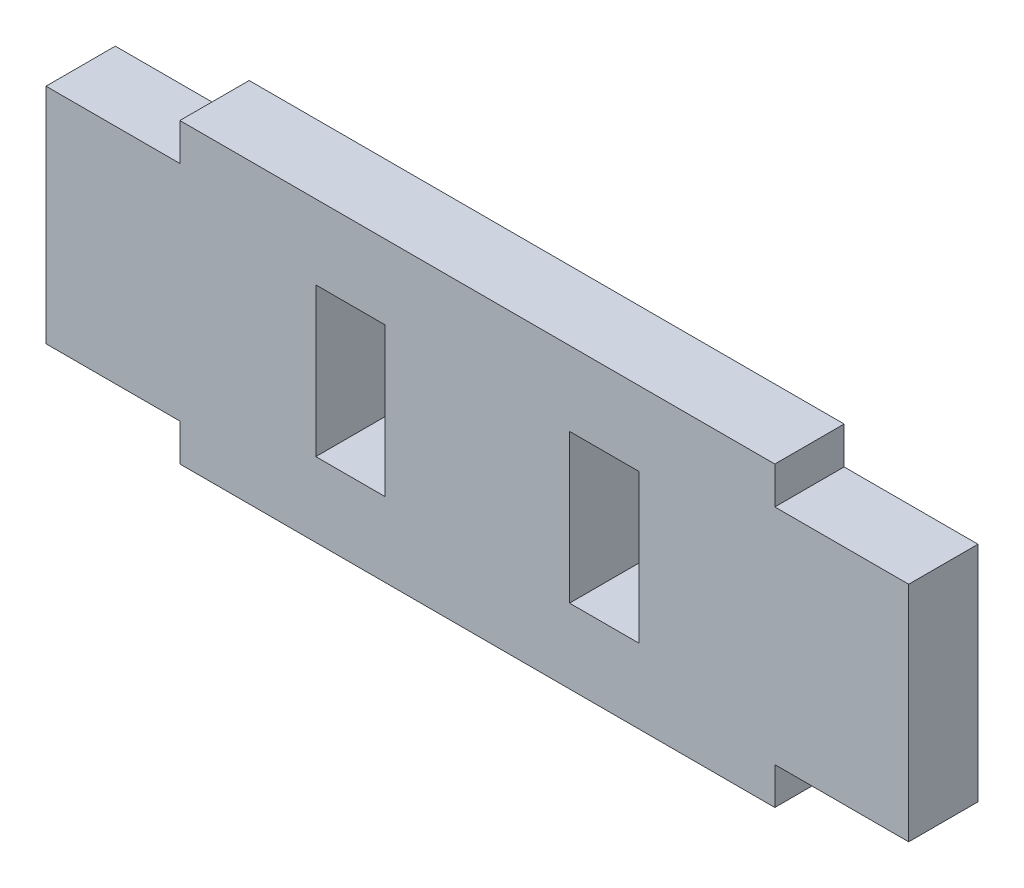
ISO-10303-21;
HEADER;
FILE_DESCRIPTION(('STEP AP214'),'2;1');
FILE_NAME('part.step','',(''),(''),'','','');
FILE_SCHEMA(('AUTOMOTIVE_DESIGN { 1 0 10303 214 1 1 1 1 }'));
ENDSEC;
DATA;
#1=APPLICATION_CONTEXT('core data for automotive mechanical design processes');
#2=APPLICATION_PROTOCOL_DEFINITION('international standard','automotive_design',2000,#1);
#3=PRODUCT_CONTEXT('',#1,'mechanical');
#4=PRODUCT('Part','Part','',(#3));
#5=PRODUCT_RELATED_PRODUCT_CATEGORY('part','',(#4));
#6=PRODUCT_DEFINITION_FORMATION('','',#4);
#7=PRODUCT_DEFINITION_CONTEXT('part definition',#1,'design');
#8=PRODUCT_DEFINITION('design','',#6,#7);
#9=PRODUCT_DEFINITION_SHAPE('','',#8);
#10=(LENGTH_UNIT() NAMED_UNIT(*) SI_UNIT(.MILLI.,.METRE.));
#11=(NAMED_UNIT(*) PLANE_ANGLE_UNIT() SI_UNIT($,.RADIAN.));
#12=(NAMED_UNIT(*) SI_UNIT($,.STERADIAN.) SOLID_ANGLE_UNIT());
#13=UNCERTAINTY_MEASURE_WITH_UNIT(LENGTH_MEASURE(1.E-05),#10,'distance_accuracy_value','');
#14=(GEOMETRIC_REPRESENTATION_CONTEXT(3) GLOBAL_UNCERTAINTY_ASSIGNED_CONTEXT((#13)) GLOBAL_UNIT_ASSIGNED_CONTEXT((#10,
#11,#12)) REPRESENTATION_CONTEXT('',''));
#15=CARTESIAN_POINT('',(0.,0.,0.));
#16=DIRECTION('',(0.,0.,1.));
#17=DIRECTION('',(1.,0.,0.));
#18=AXIS2_PLACEMENT_3D('',#15,#16,#17);
#19=CARTESIAN_POINT('',(0.,0.,1.47955));
#20=DIRECTION('',(0.,0.,1.));
#21=DIRECTION('',(1.,0.,0.));
#22=AXIS2_PLACEMENT_3D('',#19,#20,#21);
#23=PLANE('',#22);
#24=DIRECTION('',(0.,1.,0.));
#25=VECTOR('',#24,1.);
#26=CARTESIAN_POINT('',(-3.937,3.175,1.47955));
#27=LINE('',#26,#25);
#28=CARTESIAN_POINT('',(-3.937,-3.175,1.47955));
#29=VERTEX_POINT('',#28);
#30=CARTESIAN_POINT('',(-3.937,3.175,1.47955));
#31=VERTEX_POINT('',#30);
#32=EDGE_CURVE('E210',#29,#31,#27,.T.);
#33=ORIENTED_EDGE('',*,*,#32,.F.);
#34=DIRECTION('',(1.,0.,0.));
#35=VECTOR('',#34,1.);
#36=CARTESIAN_POINT('',(-3.937,-3.175,1.47955));
#37=LINE('',#36,#35);
#38=CARTESIAN_POINT('',(-6.8961,-3.175,1.47955));
#39=VERTEX_POINT('',#38);
#40=EDGE_CURVE('E208',#39,#29,#37,.T.);
#41=ORIENTED_EDGE('',*,*,#40,.F.);
#42=DIRECTION('',(0.,-1.,0.));
#43=VECTOR('',#42,1.);
#44=CARTESIAN_POINT('',(-6.8961,3.175,1.47955));
#45=LINE('',#44,#43);
#46=CARTESIAN_POINT('',(-6.8961,3.175,1.47955));
#47=VERTEX_POINT('',#46);
#48=EDGE_CURVE('E216',#47,#39,#45,.T.);
#49=ORIENTED_EDGE('',*,*,#48,.F.);
#50=DIRECTION('',(-1.,0.,0.));
#51=VECTOR('',#50,1.);
#52=CARTESIAN_POINT('',(-3.937,3.175,1.47955));
#53=LINE('',#52,#51);
#54=EDGE_CURVE('E213',#31,#47,#53,.T.);
#55=ORIENTED_EDGE('',*,*,#54,.F.);
#56=EDGE_LOOP('',(#33,#41,#49,#55));
#57=FACE_BOUND('',#56,.T.);
#58=DIRECTION('',(0.,1.,0.));
#59=VECTOR('',#58,1.);
#60=CARTESIAN_POINT('',(12.7,-4.7625,1.47955));
#61=LINE('',#60,#59);
#62=CARTESIAN_POINT('',(12.7,-6.35,1.47955));
#63=VERTEX_POINT('',#62);
#64=CARTESIAN_POINT('',(12.7,-4.7625,1.47955));
#65=VERTEX_POINT('',#64);
#66=EDGE_CURVE('E239',#63,#65,#61,.T.);
#67=ORIENTED_EDGE('',*,*,#66,.T.);
#68=DIRECTION('',(1.,0.,0.));
#69=VECTOR('',#68,1.);
#70=CARTESIAN_POINT('',(12.7,-4.7625,1.47955));
#71=LINE('',#70,#69);
#72=CARTESIAN_POINT('',(18.415,-4.7625,1.47955));
#73=VERTEX_POINT('',#72);
#74=EDGE_CURVE('E242',#65,#73,#71,.T.);
#75=ORIENTED_EDGE('',*,*,#74,.T.);
#76=DIRECTION('',(0.,1.,0.));
#77=VECTOR('',#76,1.);
#78=CARTESIAN_POINT('',(18.415,4.7625,1.47955));
#79=LINE('',#78,#77);
#80=CARTESIAN_POINT('',(18.415,4.7625,1.47955));
#81=VERTEX_POINT('',#80);
#82=EDGE_CURVE('E245',#73,#81,#79,.T.);
#83=ORIENTED_EDGE('',*,*,#82,.T.);
#84=DIRECTION('',(-1.,0.,0.));
#85=VECTOR('',#84,1.);
#86=CARTESIAN_POINT('',(12.7,4.7625,1.47955));
#87=LINE('',#86,#85);
#88=CARTESIAN_POINT('',(12.7,4.7625,1.47955));
#89=VERTEX_POINT('',#88);
#90=EDGE_CURVE('E247',#81,#89,#87,.T.);
#91=ORIENTED_EDGE('',*,*,#90,.T.);
#92=DIRECTION('',(0.,1.,0.));
#93=VECTOR('',#92,1.);
#94=CARTESIAN_POINT('',(12.7,6.35,1.47955));
#95=LINE('',#94,#93);
#96=CARTESIAN_POINT('',(12.7,6.35,1.47955));
#97=VERTEX_POINT('',#96);
#98=EDGE_CURVE('E249',#89,#97,#95,.T.);
#99=ORIENTED_EDGE('',*,*,#98,.T.);
#100=DIRECTION('',(-1.,0.,0.));
#101=VECTOR('',#100,1.);
#102=CARTESIAN_POINT('',(-12.7,6.35,1.47955));
#103=LINE('',#102,#101);
#104=CARTESIAN_POINT('',(-12.7,6.35,1.47955));
#105=VERTEX_POINT('',#104);
#106=EDGE_CURVE('E251',#97,#105,#103,.T.);
#107=ORIENTED_EDGE('',*,*,#106,.T.);
#108=DIRECTION('',(0.,-1.,0.));
#109=VECTOR('',#108,1.);
#110=CARTESIAN_POINT('',(-12.7,6.35,1.47955));
#111=LINE('',#110,#109);
#112=CARTESIAN_POINT('',(-12.7,4.7625,1.47955));
#113=VERTEX_POINT('',#112);
#114=EDGE_CURVE('E253',#105,#113,#111,.T.);
#115=ORIENTED_EDGE('',*,*,#114,.T.);
#116=DIRECTION('',(-1.,0.,0.));
#117=VECTOR('',#116,1.);
#118=CARTESIAN_POINT('',(-12.7,4.7625,1.47955));
#119=LINE('',#118,#117);
#120=CARTESIAN_POINT('',(-18.415,4.7625,1.47955));
#121=VERTEX_POINT('',#120);
#122=EDGE_CURVE('E255',#113,#121,#119,.T.);
#123=ORIENTED_EDGE('',*,*,#122,.T.);
#124=DIRECTION('',(0.,-1.,0.));
#125=VECTOR('',#124,1.);
#126=CARTESIAN_POINT('',(-18.415,4.7625,1.47955));
#127=LINE('',#126,#125);
#128=CARTESIAN_POINT('',(-18.415,-4.7625,1.47955));
#129=VERTEX_POINT('',#128);
#130=EDGE_CURVE('E257',#121,#129,#127,.T.);
#131=ORIENTED_EDGE('',*,*,#130,.T.);
#132=DIRECTION('',(1.,0.,0.));
#133=VECTOR('',#132,1.);
#134=CARTESIAN_POINT('',(-12.7,-4.7625,1.47955));
#135=LINE('',#134,#133);
#136=CARTESIAN_POINT('',(-12.7,-4.7625,1.47955));
#137=VERTEX_POINT('',#136);
#138=EDGE_CURVE('E259',#129,#137,#135,.T.);
#139=ORIENTED_EDGE('',*,*,#138,.T.);
#140=DIRECTION('',(0.,-1.,0.));
#141=VECTOR('',#140,1.);
#142=CARTESIAN_POINT('',(-12.7,-4.7625,1.47955));
#143=LINE('',#142,#141);
#144=CARTESIAN_POINT('',(-12.7,-6.35,1.47955));
#145=VERTEX_POINT('',#144);
#146=EDGE_CURVE('E261',#137,#145,#143,.T.);
#147=ORIENTED_EDGE('',*,*,#146,.T.);
#148=DIRECTION('',(1.,0.,0.));
#149=VECTOR('',#148,1.);
#150=CARTESIAN_POINT('',(-12.7,-6.35,1.47955));
#151=LINE('',#150,#149);
#152=EDGE_CURVE('E263',#145,#63,#151,.T.);
#153=ORIENTED_EDGE('',*,*,#152,.T.);
#154=EDGE_LOOP('',(#67,#75,#83,#91,#99,#107,#115,#123,#131,#139,#147,#153));
#155=FACE_BOUND('',#154,.T.);
#156=DIRECTION('',(1.,0.,0.));
#157=VECTOR('',#156,1.);
#158=CARTESIAN_POINT('',(3.937,-3.175,1.47955));
#159=LINE('',#158,#157);
#160=CARTESIAN_POINT('',(3.937,-3.175,1.47955));
#161=VERTEX_POINT('',#160);
#162=CARTESIAN_POINT('',(6.8961,-3.175,1.47955));
#163=VERTEX_POINT('',#162);
#164=EDGE_CURVE('E180',#161,#163,#159,.T.);
#165=ORIENTED_EDGE('',*,*,#164,.F.);
#166=DIRECTION('',(0.,-1.,0.));
#167=VECTOR('',#166,1.);
#168=CARTESIAN_POINT('',(3.937,3.175,1.47955));
#169=LINE('',#168,#167);
#170=CARTESIAN_POINT('',(3.937,3.175,1.47955));
#171=VERTEX_POINT('',#170);
#172=EDGE_CURVE('E172',#171,#161,#169,.T.);
#173=ORIENTED_EDGE('',*,*,#172,.F.);
#174=DIRECTION('',(-1.,0.,0.));
#175=VECTOR('',#174,1.);
#176=CARTESIAN_POINT('',(3.937,3.175,1.47955));
#177=LINE('',#176,#175);
#178=CARTESIAN_POINT('',(6.8961,3.175,1.47955));
#179=VERTEX_POINT('',#178);
#180=EDGE_CURVE('E194',#179,#171,#177,.T.);
#181=ORIENTED_EDGE('',*,*,#180,.F.);
#182=DIRECTION('',(0.,1.,0.));
#183=VECTOR('',#182,1.);
#184=CARTESIAN_POINT('',(6.8961,3.175,1.47955));
#185=LINE('',#184,#183);
#186=EDGE_CURVE('E192',#163,#179,#185,.T.);
#187=ORIENTED_EDGE('',*,*,#186,.F.);
#188=EDGE_LOOP('',(#165,#173,#181,#187));
#189=FACE_BOUND('',#188,.T.);
#190=ADVANCED_FACE('F35',(#57,#155,#189),#23,.T.);
#191=CARTESIAN_POINT('',(0.,0.,-1.47955));
#192=DIRECTION('',(0.,0.,1.));
#193=DIRECTION('',(1.,0.,0.));
#194=AXIS2_PLACEMENT_3D('',#191,#192,#193);
#195=PLANE('',#194);
#196=DIRECTION('',(1.,0.,0.));
#197=VECTOR('',#196,1.);
#198=CARTESIAN_POINT('',(-3.937,-3.175,-1.47955));
#199=LINE('',#198,#197);
#200=CARTESIAN_POINT('',(-6.8961,-3.175,-1.47955));
#201=VERTEX_POINT('',#200);
#202=CARTESIAN_POINT('',(-3.937,-3.175,-1.47955));
#203=VERTEX_POINT('',#202);
#204=EDGE_CURVE('E188',#201,#203,#199,.T.);
#205=ORIENTED_EDGE('',*,*,#204,.T.);
#206=DIRECTION('',(0.,1.,0.));
#207=VECTOR('',#206,1.);
#208=CARTESIAN_POINT('',(-3.937,3.175,-1.47955));
#209=LINE('',#208,#207);
#210=CARTESIAN_POINT('',(-3.937,3.175,-1.47955));
#211=VERTEX_POINT('',#210);
#212=EDGE_CURVE('E221',#203,#211,#209,.T.);
#213=ORIENTED_EDGE('',*,*,#212,.T.);
#214=DIRECTION('',(-1.,0.,0.));
#215=VECTOR('',#214,1.);
#216=CARTESIAN_POINT('',(-3.937,3.175,-1.47955));
#217=LINE('',#216,#215);
#218=CARTESIAN_POINT('',(-6.8961,3.175,-1.47955));
#219=VERTEX_POINT('',#218);
#220=EDGE_CURVE('E224',#211,#219,#217,.T.);
#221=ORIENTED_EDGE('',*,*,#220,.T.);
#222=DIRECTION('',(0.,-1.,0.));
#223=VECTOR('',#222,1.);
#224=CARTESIAN_POINT('',(-6.8961,3.175,-1.47955));
#225=LINE('',#224,#223);
#226=EDGE_CURVE('E211',#219,#201,#225,.T.);
#227=ORIENTED_EDGE('',*,*,#226,.T.);
#228=EDGE_LOOP('',(#205,#213,#221,#227));
#229=FACE_BOUND('',#228,.T.);
#230=DIRECTION('',(0.,1.,0.));
#231=VECTOR('',#230,1.);
#232=CARTESIAN_POINT('',(12.7,-4.7625,-1.47955));
#233=LINE('',#232,#231);
#234=CARTESIAN_POINT('',(12.7,-6.35,-1.47955));
#235=VERTEX_POINT('',#234);
#236=CARTESIAN_POINT('',(12.7,-4.7625,-1.47955));
#237=VERTEX_POINT('',#236);
#238=EDGE_CURVE('E238',#235,#237,#233,.T.);
#239=ORIENTED_EDGE('',*,*,#238,.F.);
#240=DIRECTION('',(1.,0.,0.));
#241=VECTOR('',#240,1.);
#242=CARTESIAN_POINT('',(-12.7,-6.35,-1.47955));
#243=LINE('',#242,#241);
#244=CARTESIAN_POINT('',(-12.7,-6.35,-1.47955));
#245=VERTEX_POINT('',#244);
#246=EDGE_CURVE('E243',#245,#235,#243,.T.);
#247=ORIENTED_EDGE('',*,*,#246,.F.);
#248=DIRECTION('',(0.,-1.,0.));
#249=VECTOR('',#248,1.);
#250=CARTESIAN_POINT('',(-12.7,-4.7625,-1.47955));
#251=LINE('',#250,#249);
#252=CARTESIAN_POINT('',(-12.7,-4.7625,-1.47955));
#253=VERTEX_POINT('',#252);
#254=EDGE_CURVE('E286',#253,#245,#251,.T.);
#255=ORIENTED_EDGE('',*,*,#254,.F.);
#256=DIRECTION('',(1.,0.,0.));
#257=VECTOR('',#256,1.);
#258=CARTESIAN_POINT('',(-12.7,-4.7625,-1.47955));
#259=LINE('',#258,#257);
#260=CARTESIAN_POINT('',(-18.415,-4.7625,-1.47955));
#261=VERTEX_POINT('',#260);
#262=EDGE_CURVE('E284',#261,#253,#259,.T.);
#263=ORIENTED_EDGE('',*,*,#262,.F.);
#264=DIRECTION('',(0.,-1.,0.));
#265=VECTOR('',#264,1.);
#266=CARTESIAN_POINT('',(-18.415,4.7625,-1.47955));
#267=LINE('',#266,#265);
#268=CARTESIAN_POINT('',(-18.415,4.7625,-1.47955));
#269=VERTEX_POINT('',#268);
#270=EDGE_CURVE('E282',#269,#261,#267,.T.);
#271=ORIENTED_EDGE('',*,*,#270,.F.);
#272=DIRECTION('',(-1.,0.,0.));
#273=VECTOR('',#272,1.);
#274=CARTESIAN_POINT('',(-12.7,4.7625,-1.47955));
#275=LINE('',#274,#273);
#276=CARTESIAN_POINT('',(-12.7,4.7625,-1.47955));
#277=VERTEX_POINT('',#276);
#278=EDGE_CURVE('E280',#277,#269,#275,.T.);
#279=ORIENTED_EDGE('',*,*,#278,.F.);
#280=DIRECTION('',(0.,-1.,0.));
#281=VECTOR('',#280,1.);
#282=CARTESIAN_POINT('',(-12.7,6.35,-1.47955));
#283=LINE('',#282,#281);
#284=CARTESIAN_POINT('',(-12.7,6.35,-1.47955));
#285=VERTEX_POINT('',#284);
#286=EDGE_CURVE('E278',#285,#277,#283,.T.);
#287=ORIENTED_EDGE('',*,*,#286,.F.);
#288=DIRECTION('',(-1.,0.,0.));
#289=VECTOR('',#288,1.);
#290=CARTESIAN_POINT('',(-12.7,6.35,-1.47955));
#291=LINE('',#290,#289);
#292=CARTESIAN_POINT('',(12.7,6.35,-1.47955));
#293=VERTEX_POINT('',#292);
#294=EDGE_CURVE('E276',#293,#285,#291,.T.);
#295=ORIENTED_EDGE('',*,*,#294,.F.);
#296=DIRECTION('',(0.,1.,0.));
#297=VECTOR('',#296,1.);
#298=CARTESIAN_POINT('',(12.7,6.35,-1.47955));
#299=LINE('',#298,#297);
#300=CARTESIAN_POINT('',(12.7,4.7625,-1.47955));
#301=VERTEX_POINT('',#300);
#302=EDGE_CURVE('E274',#301,#293,#299,.T.);
#303=ORIENTED_EDGE('',*,*,#302,.F.);
#304=DIRECTION('',(-1.,0.,0.));
#305=VECTOR('',#304,1.);
#306=CARTESIAN_POINT('',(12.7,4.7625,-1.47955));
#307=LINE('',#306,#305);
#308=CARTESIAN_POINT('',(18.415,4.7625,-1.47955));
#309=VERTEX_POINT('',#308);
#310=EDGE_CURVE('E272',#309,#301,#307,.T.);
#311=ORIENTED_EDGE('',*,*,#310,.F.);
#312=DIRECTION('',(0.,1.,0.));
#313=VECTOR('',#312,1.);
#314=CARTESIAN_POINT('',(18.415,4.7625,-1.47955));
#315=LINE('',#314,#313);
#316=CARTESIAN_POINT('',(18.415,-4.7625,-1.47955));
#317=VERTEX_POINT('',#316);
#318=EDGE_CURVE('E270',#317,#309,#315,.T.);
#319=ORIENTED_EDGE('',*,*,#318,.F.);
#320=DIRECTION('',(1.,0.,0.));
#321=VECTOR('',#320,1.);
#322=CARTESIAN_POINT('',(12.7,-4.7625,-1.47955));
#323=LINE('',#322,#321);
#324=EDGE_CURVE('E268',#237,#317,#323,.T.);
#325=ORIENTED_EDGE('',*,*,#324,.F.);
#326=EDGE_LOOP('',(#239,#247,#255,#263,#271,#279,#287,#295,#303,#311,#319,#325));
#327=FACE_BOUND('',#326,.T.);
#328=DIRECTION('',(0.,-1.,0.));
#329=VECTOR('',#328,1.);
#330=CARTESIAN_POINT('',(3.937,3.175,-1.47955));
#331=LINE('',#330,#329);
#332=CARTESIAN_POINT('',(3.937,3.175,-1.47955));
#333=VERTEX_POINT('',#332);
#334=CARTESIAN_POINT('',(3.937,-3.175,-1.47955));
#335=VERTEX_POINT('',#334);
#336=EDGE_CURVE('E58',#333,#335,#331,.T.);
#337=ORIENTED_EDGE('',*,*,#336,.T.);
#338=DIRECTION('',(1.,0.,0.));
#339=VECTOR('',#338,1.);
#340=CARTESIAN_POINT('',(3.937,-3.175,-1.47955));
#341=LINE('',#340,#339);
#342=CARTESIAN_POINT('',(6.8961,-3.175,-1.47955));
#343=VERTEX_POINT('',#342);
#344=EDGE_CURVE('E187',#335,#343,#341,.T.);
#345=ORIENTED_EDGE('',*,*,#344,.T.);
#346=DIRECTION('',(0.,1.,0.));
#347=VECTOR('',#346,1.);
#348=CARTESIAN_POINT('',(6.8961,3.175,-1.47955));
#349=LINE('',#348,#347);
#350=CARTESIAN_POINT('',(6.8961,3.175,-1.47955));
#351=VERTEX_POINT('',#350);
#352=EDGE_CURVE('E200',#343,#351,#349,.T.);
#353=ORIENTED_EDGE('',*,*,#352,.T.);
#354=DIRECTION('',(-1.,0.,0.));
#355=VECTOR('',#354,1.);
#356=CARTESIAN_POINT('',(3.937,3.175,-1.47955));
#357=LINE('',#356,#355);
#358=EDGE_CURVE('E181',#351,#333,#357,.T.);
#359=ORIENTED_EDGE('',*,*,#358,.T.);
#360=EDGE_LOOP('',(#337,#345,#353,#359));
#361=FACE_BOUND('',#360,.T.);
#362=ADVANCED_FACE('F328',(#229,#327,#361),#195,.F.);
#363=CARTESIAN_POINT('',(12.7,-4.7625,1.47955));
#364=DIRECTION('',(-1.,0.,0.));
#365=DIRECTION('',(0.,-1.,0.));
#366=AXIS2_PLACEMENT_3D('',#363,#364,#365);
#367=PLANE('',#366);
#368=ORIENTED_EDGE('',*,*,#238,.T.);
#369=DIRECTION('',(0.,0.,-1.));
#370=VECTOR('',#369,1.);
#371=CARTESIAN_POINT('',(12.7,-4.7625,1.47955));
#372=LINE('',#371,#370);
#373=EDGE_CURVE('E11',#65,#237,#372,.T.);
#374=ORIENTED_EDGE('',*,*,#373,.F.);
#375=ORIENTED_EDGE('',*,*,#66,.F.);
#376=DIRECTION('',(0.,0.,-1.));
#377=VECTOR('',#376,1.);
#378=CARTESIAN_POINT('',(12.7,-6.35,1.47955));
#379=LINE('',#378,#377);
#380=EDGE_CURVE('E265',#63,#235,#379,.T.);
#381=ORIENTED_EDGE('',*,*,#380,.T.);
#382=EDGE_LOOP('',(#368,#374,#375,#381));
#383=FACE_BOUND('',#382,.T.);
#384=ADVANCED_FACE('F37',(#383),#367,.F.);
#385=CARTESIAN_POINT('',(12.7,-4.7625,1.47955));
#386=DIRECTION('',(0.,1.,0.));
#387=DIRECTION('',(0.,0.,1.));
#388=AXIS2_PLACEMENT_3D('',#385,#386,#387);
#389=PLANE('',#388);
#390=ORIENTED_EDGE('',*,*,#324,.T.);
#391=DIRECTION('',(0.,0.,-1.));
#392=VECTOR('',#391,1.);
#393=CARTESIAN_POINT('',(18.415,-4.7625,1.47955));
#394=LINE('',#393,#392);
#395=EDGE_CURVE('E43',#73,#317,#394,.T.);
#396=ORIENTED_EDGE('',*,*,#395,.F.);
#397=ORIENTED_EDGE('',*,*,#74,.F.);
#398=ORIENTED_EDGE('',*,*,#373,.T.);
#399=EDGE_LOOP('',(#390,#396,#397,#398));
#400=FACE_BOUND('',#399,.T.);
#401=ADVANCED_FACE('F345',(#400),#389,.F.);
#402=CARTESIAN_POINT('',(18.415,4.7625,1.47955));
#403=DIRECTION('',(-1.,0.,0.));
#404=DIRECTION('',(0.,0.,1.));
#405=AXIS2_PLACEMENT_3D('',#402,#403,#404);
#406=PLANE('',#405);
#407=ORIENTED_EDGE('',*,*,#318,.T.);
#408=DIRECTION('',(0.,0.,-1.));
#409=VECTOR('',#408,1.);
#410=CARTESIAN_POINT('',(18.415,4.7625,1.47955));
#411=LINE('',#410,#409);
#412=EDGE_CURVE('E315',#81,#309,#411,.T.);
#413=ORIENTED_EDGE('',*,*,#412,.F.);
#414=ORIENTED_EDGE('',*,*,#82,.F.);
#415=ORIENTED_EDGE('',*,*,#395,.T.);
#416=EDGE_LOOP('',(#407,#413,#414,#415));
#417=FACE_BOUND('',#416,.T.);
#418=ADVANCED_FACE('F322',(#417),#406,.F.);
#419=CARTESIAN_POINT('',(12.7,4.7625,1.47955));
#420=DIRECTION('',(0.,-1.,0.));
#421=DIRECTION('',(0.,0.,-1.));
#422=AXIS2_PLACEMENT_3D('',#419,#420,#421);
#423=PLANE('',#422);
#424=ORIENTED_EDGE('',*,*,#310,.T.);
#425=DIRECTION('',(0.,0.,-1.));
#426=VECTOR('',#425,1.);
#427=CARTESIAN_POINT('',(12.7,4.7625,1.47955));
#428=LINE('',#427,#426);
#429=EDGE_CURVE('E312',#89,#301,#428,.T.);
#430=ORIENTED_EDGE('',*,*,#429,.F.);
#431=ORIENTED_EDGE('',*,*,#90,.F.);
#432=ORIENTED_EDGE('',*,*,#412,.T.);
#433=EDGE_LOOP('',(#424,#430,#431,#432));
#434=FACE_BOUND('',#433,.T.);
#435=ADVANCED_FACE('F334',(#434),#423,.F.);
#436=CARTESIAN_POINT('',(12.7,6.35,1.47955));
#437=DIRECTION('',(-1.,0.,0.));
#438=DIRECTION('',(0.,-1.,0.));
#439=AXIS2_PLACEMENT_3D('',#436,#437,#438);
#440=PLANE('',#439);
#441=ORIENTED_EDGE('',*,*,#302,.T.);
#442=DIRECTION('',(0.,0.,-1.));
#443=VECTOR('',#442,1.);
#444=CARTESIAN_POINT('',(12.7,6.35,1.47955));
#445=LINE('',#444,#443);
#446=EDGE_CURVE('E309',#97,#293,#445,.T.);
#447=ORIENTED_EDGE('',*,*,#446,.F.);
#448=ORIENTED_EDGE('',*,*,#98,.F.);
#449=ORIENTED_EDGE('',*,*,#429,.T.);
#450=EDGE_LOOP('',(#441,#447,#448,#449));
#451=FACE_BOUND('',#450,.T.);
#452=ADVANCED_FACE('F338',(#451),#440,.F.);
#453=CARTESIAN_POINT('',(-12.7,6.35,1.47955));
#454=DIRECTION('',(0.,-1.,0.));
#455=DIRECTION('',(0.,0.,-1.));
#456=AXIS2_PLACEMENT_3D('',#453,#454,#455);
#457=PLANE('',#456);
#458=ORIENTED_EDGE('',*,*,#294,.T.);
#459=DIRECTION('',(0.,0.,-1.));
#460=VECTOR('',#459,1.);
#461=CARTESIAN_POINT('',(-12.7,6.35,1.47955));
#462=LINE('',#461,#460);
#463=EDGE_CURVE('E306',#105,#285,#462,.T.);
#464=ORIENTED_EDGE('',*,*,#463,.F.);
#465=ORIENTED_EDGE('',*,*,#106,.F.);
#466=ORIENTED_EDGE('',*,*,#446,.T.);
#467=EDGE_LOOP('',(#458,#464,#465,#466));
#468=FACE_BOUND('',#467,.T.);
#469=ADVANCED_FACE('F378',(#468),#457,.F.);
#470=CARTESIAN_POINT('',(-12.7,6.35,1.47955));
#471=DIRECTION('',(1.,0.,0.));
#472=DIRECTION('',(0.,1.,0.));
#473=AXIS2_PLACEMENT_3D('',#470,#471,#472);
#474=PLANE('',#473);
#475=ORIENTED_EDGE('',*,*,#286,.T.);
#476=DIRECTION('',(0.,0.,-1.));
#477=VECTOR('',#476,1.);
#478=CARTESIAN_POINT('',(-12.7,4.7625,1.47955));
#479=LINE('',#478,#477);
#480=EDGE_CURVE('E303',#113,#277,#479,.T.);
#481=ORIENTED_EDGE('',*,*,#480,.F.);
#482=ORIENTED_EDGE('',*,*,#114,.F.);
#483=ORIENTED_EDGE('',*,*,#463,.T.);
#484=EDGE_LOOP('',(#475,#481,#482,#483));
#485=FACE_BOUND('',#484,.T.);
#486=ADVANCED_FACE('F376',(#485),#474,.F.);
#487=CARTESIAN_POINT('',(-12.7,4.7625,1.47955));
#488=DIRECTION('',(0.,-1.,0.));
#489=DIRECTION('',(0.,0.,-1.));
#490=AXIS2_PLACEMENT_3D('',#487,#488,#489);
#491=PLANE('',#490);
#492=ORIENTED_EDGE('',*,*,#278,.T.);
#493=DIRECTION('',(0.,0.,-1.));
#494=VECTOR('',#493,1.);
#495=CARTESIAN_POINT('',(-18.415,4.7625,1.47955));
#496=LINE('',#495,#494);
#497=EDGE_CURVE('E300',#121,#269,#496,.T.);
#498=ORIENTED_EDGE('',*,*,#497,.F.);
#499=ORIENTED_EDGE('',*,*,#122,.F.);
#500=ORIENTED_EDGE('',*,*,#480,.T.);
#501=EDGE_LOOP('',(#492,#498,#499,#500));
#502=FACE_BOUND('',#501,.T.);
#503=ADVANCED_FACE('F372',(#502),#491,.F.);
#504=CARTESIAN_POINT('',(-18.415,4.7625,1.47955));
#505=DIRECTION('',(1.,0.,0.));
#506=DIRECTION('',(0.,0.,-1.));
#507=AXIS2_PLACEMENT_3D('',#504,#505,#506);
#508=PLANE('',#507);
#509=ORIENTED_EDGE('',*,*,#270,.T.);
#510=DIRECTION('',(0.,0.,-1.));
#511=VECTOR('',#510,1.);
#512=CARTESIAN_POINT('',(-18.415,-4.7625,1.47955));
#513=LINE('',#512,#511);
#514=EDGE_CURVE('E297',#129,#261,#513,.T.);
#515=ORIENTED_EDGE('',*,*,#514,.F.);
#516=ORIENTED_EDGE('',*,*,#130,.F.);
#517=ORIENTED_EDGE('',*,*,#497,.T.);
#518=EDGE_LOOP('',(#509,#515,#516,#517));
#519=FACE_BOUND('',#518,.T.);
#520=ADVANCED_FACE('F367',(#519),#508,.F.);
#521=CARTESIAN_POINT('',(-12.7,-4.7625,1.47955));
#522=DIRECTION('',(0.,1.,0.));
#523=DIRECTION('',(0.,0.,1.));
#524=AXIS2_PLACEMENT_3D('',#521,#522,#523);
#525=PLANE('',#524);
#526=ORIENTED_EDGE('',*,*,#262,.T.);
#527=DIRECTION('',(0.,0.,-1.));
#528=VECTOR('',#527,1.);
#529=CARTESIAN_POINT('',(-12.7,-4.7625,1.47955));
#530=LINE('',#529,#528);
#531=EDGE_CURVE('E294',#137,#253,#530,.T.);
#532=ORIENTED_EDGE('',*,*,#531,.F.);
#533=ORIENTED_EDGE('',*,*,#138,.F.);
#534=ORIENTED_EDGE('',*,*,#514,.T.);
#535=EDGE_LOOP('',(#526,#532,#533,#534));
#536=FACE_BOUND('',#535,.T.);
#537=ADVANCED_FACE('F361',(#536),#525,.F.);
#538=CARTESIAN_POINT('',(-12.7,-4.7625,1.47955));
#539=DIRECTION('',(1.,0.,0.));
#540=DIRECTION('',(0.,1.,0.));
#541=AXIS2_PLACEMENT_3D('',#538,#539,#540);
#542=PLANE('',#541);
#543=ORIENTED_EDGE('',*,*,#254,.T.);
#544=DIRECTION('',(0.,0.,-1.));
#545=VECTOR('',#544,1.);
#546=CARTESIAN_POINT('',(-12.7,-6.35,1.47955));
#547=LINE('',#546,#545);
#548=EDGE_CURVE('E291',#145,#245,#547,.T.);
#549=ORIENTED_EDGE('',*,*,#548,.F.);
#550=ORIENTED_EDGE('',*,*,#146,.F.);
#551=ORIENTED_EDGE('',*,*,#531,.T.);
#552=EDGE_LOOP('',(#543,#549,#550,#551));
#553=FACE_BOUND('',#552,.T.);
#554=ADVANCED_FACE('F357',(#553),#542,.F.);
#555=CARTESIAN_POINT('',(-12.7,-6.35,1.47955));
#556=DIRECTION('',(0.,1.,0.));
#557=DIRECTION('',(0.,0.,1.));
#558=AXIS2_PLACEMENT_3D('',#555,#556,#557);
#559=PLANE('',#558);
#560=ORIENTED_EDGE('',*,*,#246,.T.);
#561=ORIENTED_EDGE('',*,*,#380,.F.);
#562=ORIENTED_EDGE('',*,*,#152,.F.);
#563=ORIENTED_EDGE('',*,*,#548,.T.);
#564=EDGE_LOOP('',(#560,#561,#562,#563));
#565=FACE_BOUND('',#564,.T.);
#566=ADVANCED_FACE('F352',(#565),#559,.F.);
#567=CARTESIAN_POINT('',(-3.937,-3.175,1.47955));
#568=DIRECTION('',(0.,1.,0.));
#569=DIRECTION('',(-1.,0.,0.));
#570=AXIS2_PLACEMENT_3D('',#567,#568,#569);
#571=PLANE('',#570);
#572=ORIENTED_EDGE('',*,*,#204,.F.);
#573=DIRECTION('',(0.,0.,-1.));
#574=VECTOR('',#573,1.);
#575=CARTESIAN_POINT('',(-6.8961,-3.175,1.47955));
#576=LINE('',#575,#574);
#577=EDGE_CURVE('E218',#39,#201,#576,.T.);
#578=ORIENTED_EDGE('',*,*,#577,.F.);
#579=ORIENTED_EDGE('',*,*,#40,.T.);
#580=DIRECTION('',(0.,0.,-1.));
#581=VECTOR('',#580,1.);
#582=CARTESIAN_POINT('',(-3.937,-3.175,1.47955));
#583=LINE('',#582,#581);
#584=EDGE_CURVE('E235',#29,#203,#583,.T.);
#585=ORIENTED_EDGE('',*,*,#584,.T.);
#586=EDGE_LOOP('',(#572,#578,#579,#585));
#587=FACE_BOUND('',#586,.T.);
#588=ADVANCED_FACE('F397',(#587),#571,.T.);
#589=CARTESIAN_POINT('',(-3.937,3.175,1.47955));
#590=DIRECTION('',(-1.,0.,0.));
#591=DIRECTION('',(0.,0.,1.));
#592=AXIS2_PLACEMENT_3D('',#589,#590,#591);
#593=PLANE('',#592);
#594=ORIENTED_EDGE('',*,*,#212,.F.);
#595=ORIENTED_EDGE('',*,*,#584,.F.);
#596=ORIENTED_EDGE('',*,*,#32,.T.);
#597=DIRECTION('',(0.,0.,-1.));
#598=VECTOR('',#597,1.);
#599=CARTESIAN_POINT('',(-3.937,3.175,1.47955));
#600=LINE('',#599,#598);
#601=EDGE_CURVE('E233',#31,#211,#600,.T.);
#602=ORIENTED_EDGE('',*,*,#601,.T.);
#603=EDGE_LOOP('',(#594,#595,#596,#602));
#604=FACE_BOUND('',#603,.T.);
#605=ADVANCED_FACE('F435',(#604),#593,.T.);
#606=CARTESIAN_POINT('',(-3.937,3.175,1.47955));
#607=DIRECTION('',(0.,-1.,0.));
#608=DIRECTION('',(1.,0.,0.));
#609=AXIS2_PLACEMENT_3D('',#606,#607,#608);
#610=PLANE('',#609);
#611=ORIENTED_EDGE('',*,*,#220,.F.);
#612=ORIENTED_EDGE('',*,*,#601,.F.);
#613=ORIENTED_EDGE('',*,*,#54,.T.);
#614=DIRECTION('',(0.,0.,-1.));
#615=VECTOR('',#614,1.);
#616=CARTESIAN_POINT('',(-6.8961,3.175,1.47955));
#617=LINE('',#616,#615);
#618=EDGE_CURVE('E231',#47,#219,#617,.T.);
#619=ORIENTED_EDGE('',*,*,#618,.T.);
#620=EDGE_LOOP('',(#611,#612,#613,#619));
#621=FACE_BOUND('',#620,.T.);
#622=ADVANCED_FACE('F442',(#621),#610,.T.);
#623=CARTESIAN_POINT('',(-6.8961,3.175,1.47955));
#624=DIRECTION('',(1.,0.,0.));
#625=DIRECTION('',(0.,0.,-1.));
#626=AXIS2_PLACEMENT_3D('',#623,#624,#625);
#627=PLANE('',#626);
#628=ORIENTED_EDGE('',*,*,#226,.F.);
#629=ORIENTED_EDGE('',*,*,#618,.F.);
#630=ORIENTED_EDGE('',*,*,#48,.T.);
#631=ORIENTED_EDGE('',*,*,#577,.T.);
#632=EDGE_LOOP('',(#628,#629,#630,#631));
#633=FACE_BOUND('',#632,.T.);
#634=ADVANCED_FACE('F449',(#633),#627,.T.);
#635=CARTESIAN_POINT('',(3.937,3.175,1.47955));
#636=DIRECTION('',(1.,0.,0.));
#637=DIRECTION('',(0.,0.,-1.));
#638=AXIS2_PLACEMENT_3D('',#635,#636,#637);
#639=PLANE('',#638);
#640=ORIENTED_EDGE('',*,*,#336,.F.);
#641=DIRECTION('',(0.,0.,-1.));
#642=VECTOR('',#641,1.);
#643=CARTESIAN_POINT('',(3.937,3.175,1.47955));
#644=LINE('',#643,#642);
#645=EDGE_CURVE('E176',#171,#333,#644,.T.);
#646=ORIENTED_EDGE('',*,*,#645,.F.);
#647=ORIENTED_EDGE('',*,*,#172,.T.);
#648=DIRECTION('',(0.,0.,-1.));
#649=VECTOR('',#648,1.);
#650=CARTESIAN_POINT('',(3.937,-3.175,1.47955));
#651=LINE('',#650,#649);
#652=EDGE_CURVE('E175',#161,#335,#651,.T.);
#653=ORIENTED_EDGE('',*,*,#652,.T.);
#654=EDGE_LOOP('',(#640,#646,#647,#653));
#655=FACE_BOUND('',#654,.T.);
#656=ADVANCED_FACE('F174',(#655),#639,.T.);
#657=CARTESIAN_POINT('',(3.937,-3.175,1.47955));
#658=DIRECTION('',(0.,1.,0.));
#659=DIRECTION('',(-1.,0.,0.));
#660=AXIS2_PLACEMENT_3D('',#657,#658,#659);
#661=PLANE('',#660);
#662=ORIENTED_EDGE('',*,*,#344,.F.);
#663=ORIENTED_EDGE('',*,*,#652,.F.);
#664=ORIENTED_EDGE('',*,*,#164,.T.);
#665=DIRECTION('',(0.,0.,-1.));
#666=VECTOR('',#665,1.);
#667=CARTESIAN_POINT('',(6.8961,-3.175,1.47955));
#668=LINE('',#667,#666);
#669=EDGE_CURVE('E189',#163,#343,#668,.T.);
#670=ORIENTED_EDGE('',*,*,#669,.T.);
#671=EDGE_LOOP('',(#662,#663,#664,#670));
#672=FACE_BOUND('',#671,.T.);
#673=ADVANCED_FACE('F184',(#672),#661,.T.);
#674=CARTESIAN_POINT('',(6.8961,3.175,1.47955));
#675=DIRECTION('',(-1.,0.,0.));
#676=DIRECTION('',(0.,0.,1.));
#677=AXIS2_PLACEMENT_3D('',#674,#675,#676);
#678=PLANE('',#677);
#679=ORIENTED_EDGE('',*,*,#352,.F.);
#680=ORIENTED_EDGE('',*,*,#669,.F.);
#681=ORIENTED_EDGE('',*,*,#186,.T.);
#682=DIRECTION('',(0.,0.,-1.));
#683=VECTOR('',#682,1.);
#684=CARTESIAN_POINT('',(6.8961,3.175,1.47955));
#685=LINE('',#684,#683);
#686=EDGE_CURVE('E50',#179,#351,#685,.T.);
#687=ORIENTED_EDGE('',*,*,#686,.T.);
#688=EDGE_LOOP('',(#679,#680,#681,#687));
#689=FACE_BOUND('',#688,.T.);
#690=ADVANCED_FACE('F470',(#689),#678,.T.);
#691=CARTESIAN_POINT('',(3.937,3.175,1.47955));
#692=DIRECTION('',(0.,-1.,0.));
#693=DIRECTION('',(1.,0.,0.));
#694=AXIS2_PLACEMENT_3D('',#691,#692,#693);
#695=PLANE('',#694);
#696=ORIENTED_EDGE('',*,*,#358,.F.);
#697=ORIENTED_EDGE('',*,*,#686,.F.);
#698=ORIENTED_EDGE('',*,*,#180,.T.);
#699=ORIENTED_EDGE('',*,*,#645,.T.);
#700=EDGE_LOOP('',(#696,#697,#698,#699));
#701=FACE_BOUND('',#700,.T.);
#702=ADVANCED_FACE('F477',(#701),#695,.T.);
#703=CLOSED_SHELL('',(#190,#362,#384,#401,#418,#435,#452,#469,#486,#503,#520,#537,#554,#566,
#588,#605,#622,#634,#656,#673,#690,#702));
#704=MANIFOLD_SOLID_BREP('B2',#703);
#705=ADVANCED_BREP_SHAPE_REPRESENTATION('',(#18,#704),#14);
#706=SHAPE_DEFINITION_REPRESENTATION(#9,#705);
ENDSEC;
END-ISO-10303-21;
